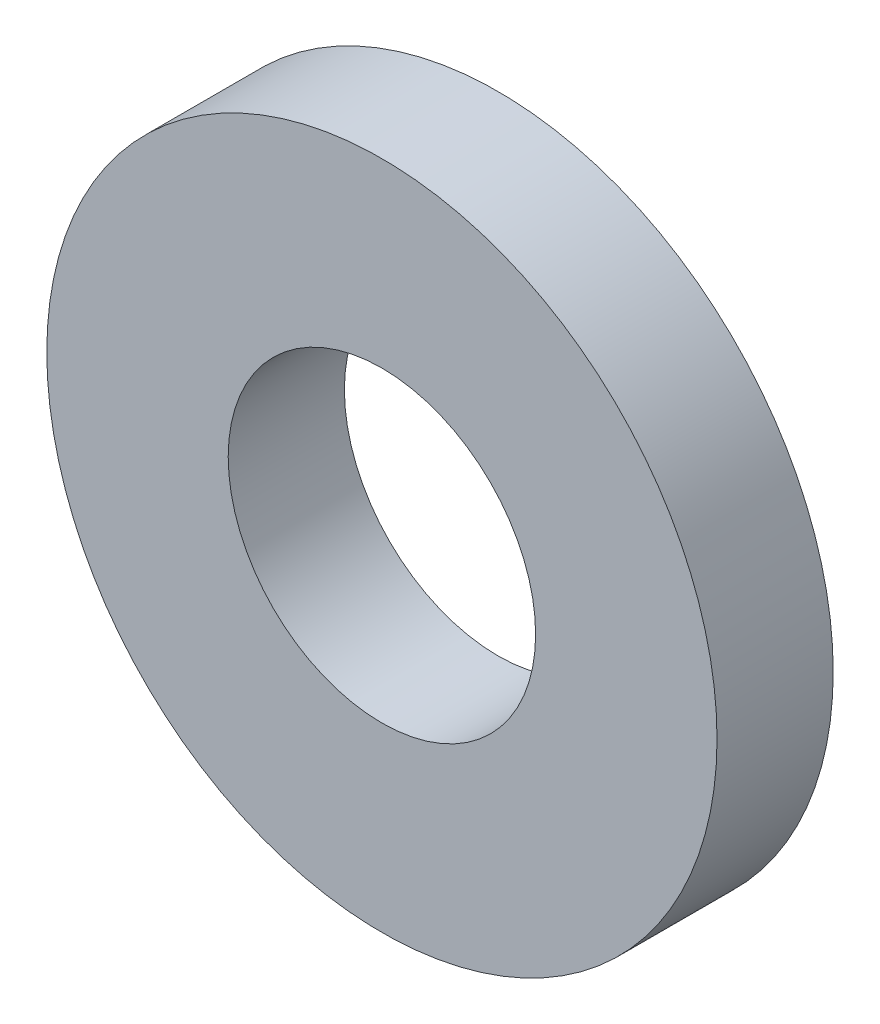
ISO-10303-21;
HEADER;
FILE_DESCRIPTION(('STEP AP214'),'2;1');
FILE_NAME('part.step','',(''),(''),'','','');
FILE_SCHEMA(('AUTOMOTIVE_DESIGN { 1 0 10303 214 1 1 1 1 }'));
ENDSEC;
DATA;
#1=APPLICATION_CONTEXT('core data for automotive mechanical design processes');
#2=APPLICATION_PROTOCOL_DEFINITION('international standard','automotive_design',2000,#1);
#3=PRODUCT_CONTEXT('',#1,'mechanical');
#4=PRODUCT('Part','Part','',(#3));
#5=PRODUCT_RELATED_PRODUCT_CATEGORY('part','',(#4));
#6=PRODUCT_DEFINITION_FORMATION('','',#4);
#7=PRODUCT_DEFINITION_CONTEXT('part definition',#1,'design');
#8=PRODUCT_DEFINITION('design','',#6,#7);
#9=PRODUCT_DEFINITION_SHAPE('','',#8);
#10=(LENGTH_UNIT() NAMED_UNIT(*) SI_UNIT(.MILLI.,.METRE.));
#11=(NAMED_UNIT(*) PLANE_ANGLE_UNIT() SI_UNIT($,.RADIAN.));
#12=(NAMED_UNIT(*) SI_UNIT($,.STERADIAN.) SOLID_ANGLE_UNIT());
#13=UNCERTAINTY_MEASURE_WITH_UNIT(LENGTH_MEASURE(1.E-05),#10,'distance_accuracy_value','');
#14=(GEOMETRIC_REPRESENTATION_CONTEXT(3) GLOBAL_UNCERTAINTY_ASSIGNED_CONTEXT((#13)) GLOBAL_UNIT_ASSIGNED_CONTEXT((#10,
#11,#12)) REPRESENTATION_CONTEXT('',''));
#15=CARTESIAN_POINT('',(0.,0.,0.));
#16=DIRECTION('',(0.,0.,1.));
#17=DIRECTION('',(1.,0.,0.));
#18=AXIS2_PLACEMENT_3D('',#15,#16,#17);
#19=CARTESIAN_POINT('',(0.,0.,1.651));
#20=DIRECTION('',(0.,0.,1.));
#21=DIRECTION('',(1.,0.,0.));
#22=AXIS2_PLACEMENT_3D('',#19,#20,#21);
#23=PLANE('',#22);
#24=CARTESIAN_POINT('',(0.,0.,1.651));
#25=DIRECTION('',(0.,0.,1.));
#26=DIRECTION('',(1.,0.,0.));
#27=AXIS2_PLACEMENT_3D('',#24,#25,#26);
#28=CIRCLE('',#27,4.7625);
#29=CARTESIAN_POINT('',(4.7625,0.,1.651));
#30=VERTEX_POINT('',#29);
#31=EDGE_CURVE('E10',#30,#30,#28,.T.);
#32=ORIENTED_EDGE('',*,*,#31,.T.);
#33=EDGE_LOOP('',(#32));
#34=FACE_BOUND('',#33,.T.);
#35=CARTESIAN_POINT('',(0.,0.,1.651));
#36=DIRECTION('',(0.,0.,1.));
#37=DIRECTION('',(1.,0.,0.));
#38=AXIS2_PLACEMENT_3D('',#35,#36,#37);
#39=CIRCLE('',#38,2.1844);
#40=CARTESIAN_POINT('',(2.1844,0.,1.651));
#41=VERTEX_POINT('',#40);
#42=EDGE_CURVE('E46',#41,#41,#39,.T.);
#43=ORIENTED_EDGE('',*,*,#42,.F.);
#44=EDGE_LOOP('',(#43));
#45=FACE_BOUND('',#44,.T.);
#46=ADVANCED_FACE('F35',(#34,#45),#23,.T.);
#47=CARTESIAN_POINT('',(0.,0.,0.));
#48=DIRECTION('',(0.,0.,1.));
#49=DIRECTION('',(1.,0.,0.));
#50=AXIS2_PLACEMENT_3D('',#47,#48,#49);
#51=PLANE('',#50);
#52=CARTESIAN_POINT('',(0.,0.,0.));
#53=DIRECTION('',(0.,0.,1.));
#54=DIRECTION('',(1.,0.,0.));
#55=AXIS2_PLACEMENT_3D('',#52,#53,#54);
#56=CIRCLE('',#55,4.7625);
#57=CARTESIAN_POINT('',(4.7625,0.,0.));
#58=VERTEX_POINT('',#57);
#59=EDGE_CURVE('E39',#58,#58,#56,.T.);
#60=ORIENTED_EDGE('',*,*,#59,.F.);
#61=EDGE_LOOP('',(#60));
#62=FACE_BOUND('',#61,.T.);
#63=CARTESIAN_POINT('',(0.,0.,0.));
#64=DIRECTION('',(0.,0.,1.));
#65=DIRECTION('',(1.,0.,0.));
#66=AXIS2_PLACEMENT_3D('',#63,#64,#65);
#67=CIRCLE('',#66,2.1844);
#68=CARTESIAN_POINT('',(2.1844,0.,0.));
#69=VERTEX_POINT('',#68);
#70=EDGE_CURVE('E48',#69,#69,#67,.T.);
#71=ORIENTED_EDGE('',*,*,#70,.T.);
#72=EDGE_LOOP('',(#71));
#73=FACE_BOUND('',#72,.T.);
#74=ADVANCED_FACE('F58',(#62,#73),#51,.F.);
#75=CARTESIAN_POINT('',(0.,0.,1.651));
#76=DIRECTION('',(0.,0.,-1.));
#77=DIRECTION('',(-1.,0.,0.));
#78=AXIS2_PLACEMENT_3D('',#75,#76,#77);
#79=CYLINDRICAL_SURFACE('',#78,4.7625);
#80=ORIENTED_EDGE('',*,*,#31,.F.);
#81=EDGE_LOOP('',(#80));
#82=FACE_BOUND('',#81,.T.);
#83=ORIENTED_EDGE('',*,*,#59,.T.);
#84=EDGE_LOOP('',(#83));
#85=FACE_BOUND('',#84,.T.);
#86=ADVANCED_FACE('F37',(#82,#85),#79,.T.);
#87=CARTESIAN_POINT('',(0.,0.,1.651));
#88=DIRECTION('',(0.,0.,-1.));
#89=DIRECTION('',(-1.,0.,0.));
#90=AXIS2_PLACEMENT_3D('',#87,#88,#89);
#91=CYLINDRICAL_SURFACE('',#90,2.1844);
#92=ORIENTED_EDGE('',*,*,#42,.T.);
#93=EDGE_LOOP('',(#92));
#94=FACE_BOUND('',#93,.T.);
#95=ORIENTED_EDGE('',*,*,#70,.F.);
#96=EDGE_LOOP('',(#95));
#97=FACE_BOUND('',#96,.T.);
#98=ADVANCED_FACE('F54',(#94,#97),#91,.F.);
#99=CLOSED_SHELL('',(#46,#74,#86,#98));
#100=MANIFOLD_SOLID_BREP('B2',#99);
#101=ADVANCED_BREP_SHAPE_REPRESENTATION('',(#18,#100),#14);
#102=SHAPE_DEFINITION_REPRESENTATION(#9,#101);
ENDSEC;
END-ISO-10303-21;
